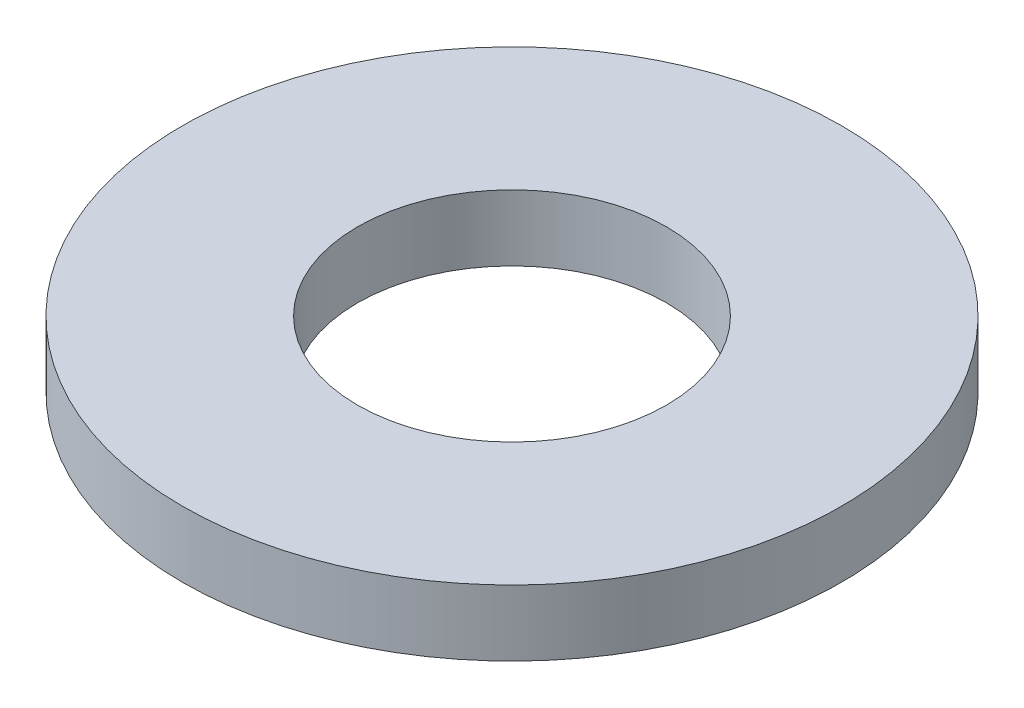
ISO-10303-21;
HEADER;
FILE_DESCRIPTION(('STEP AP214'),'2;1');
FILE_NAME('part.step','',(''),(''),'','','');
FILE_SCHEMA(('AUTOMOTIVE_DESIGN { 1 0 10303 214 1 1 1 1 }'));
ENDSEC;
DATA;
#1=APPLICATION_CONTEXT('core data for automotive mechanical design processes');
#2=APPLICATION_PROTOCOL_DEFINITION('international standard','automotive_design',2000,#1);
#3=PRODUCT_CONTEXT('',#1,'mechanical');
#4=PRODUCT('Part','Part','',(#3));
#5=PRODUCT_RELATED_PRODUCT_CATEGORY('part','',(#4));
#6=PRODUCT_DEFINITION_FORMATION('','',#4);
#7=PRODUCT_DEFINITION_CONTEXT('part definition',#1,'design');
#8=PRODUCT_DEFINITION('design','',#6,#7);
#9=PRODUCT_DEFINITION_SHAPE('','',#8);
#10=(LENGTH_UNIT() NAMED_UNIT(*) SI_UNIT(.MILLI.,.METRE.));
#11=(NAMED_UNIT(*) PLANE_ANGLE_UNIT() SI_UNIT($,.RADIAN.));
#12=(NAMED_UNIT(*) SI_UNIT($,.STERADIAN.) SOLID_ANGLE_UNIT());
#13=UNCERTAINTY_MEASURE_WITH_UNIT(LENGTH_MEASURE(1.E-05),#10,'distance_accuracy_value','');
#14=(GEOMETRIC_REPRESENTATION_CONTEXT(3) GLOBAL_UNCERTAINTY_ASSIGNED_CONTEXT((#13)) GLOBAL_UNIT_ASSIGNED_CONTEXT((#10,
#11,#12)) REPRESENTATION_CONTEXT('',''));
#15=CARTESIAN_POINT('',(0.,0.,0.));
#16=DIRECTION('',(0.,0.,1.));
#17=DIRECTION('',(1.,0.,0.));
#18=AXIS2_PLACEMENT_3D('',#15,#16,#17);
#19=CARTESIAN_POINT('',(0.,16.,0.));
#20=DIRECTION('',(0.,-1.,0.));
#21=DIRECTION('',(0.,0.,-1.));
#22=AXIS2_PLACEMENT_3D('',#19,#20,#21);
#23=CYLINDRICAL_SURFACE('',#22,80.);
#24=CARTESIAN_POINT('',(0.,16.,0.));
#25=DIRECTION('',(0.,1.,0.));
#26=DIRECTION('',(0.,0.,1.));
#27=AXIS2_PLACEMENT_3D('',#24,#25,#26);
#28=CIRCLE('',#27,80.);
#29=CARTESIAN_POINT('',(0.,16.,80.));
#30=VERTEX_POINT('',#29);
#31=EDGE_CURVE('E10',#30,#30,#28,.T.);
#32=ORIENTED_EDGE('',*,*,#31,.F.);
#33=EDGE_LOOP('',(#32));
#34=FACE_BOUND('',#33,.T.);
#35=CARTESIAN_POINT('',(0.,0.,0.));
#36=DIRECTION('',(0.,1.,0.));
#37=DIRECTION('',(0.,0.,1.));
#38=AXIS2_PLACEMENT_3D('',#35,#36,#37);
#39=CIRCLE('',#38,80.);
#40=CARTESIAN_POINT('',(0.,0.,80.));
#41=VERTEX_POINT('',#40);
#42=EDGE_CURVE('E37',#41,#41,#39,.T.);
#43=ORIENTED_EDGE('',*,*,#42,.T.);
#44=EDGE_LOOP('',(#43));
#45=FACE_BOUND('',#44,.T.);
#46=ADVANCED_FACE('F40',(#34,#45),#23,.T.);
#47=CARTESIAN_POINT('',(0.,16.,0.));
#48=DIRECTION('',(0.,1.,0.));
#49=DIRECTION('',(0.,0.,1.));
#50=AXIS2_PLACEMENT_3D('',#47,#48,#49);
#51=PLANE('',#50);
#52=CARTESIAN_POINT('',(0.,16.,0.));
#53=DIRECTION('',(0.,1.,0.));
#54=DIRECTION('',(0.,0.,1.));
#55=AXIS2_PLACEMENT_3D('',#52,#53,#54);
#56=CIRCLE('',#55,37.5);
#57=CARTESIAN_POINT('',(0.,16.,37.5));
#58=VERTEX_POINT('',#57);
#59=EDGE_CURVE('E50',#58,#58,#56,.T.);
#60=ORIENTED_EDGE('',*,*,#59,.F.);
#61=EDGE_LOOP('',(#60));
#62=FACE_BOUND('',#61,.T.);
#63=ORIENTED_EDGE('',*,*,#31,.T.);
#64=EDGE_LOOP('',(#63));
#65=FACE_BOUND('',#64,.T.);
#66=ADVANCED_FACE('F59',(#62,#65),#51,.T.);
#67=CARTESIAN_POINT('',(0.,0.,0.));
#68=DIRECTION('',(0.,1.,0.));
#69=DIRECTION('',(0.,0.,1.));
#70=AXIS2_PLACEMENT_3D('',#67,#68,#69);
#71=PLANE('',#70);
#72=CARTESIAN_POINT('',(0.,0.,0.));
#73=DIRECTION('',(0.,1.,0.));
#74=DIRECTION('',(0.,0.,1.));
#75=AXIS2_PLACEMENT_3D('',#72,#73,#74);
#76=CIRCLE('',#75,37.5);
#77=CARTESIAN_POINT('',(0.,0.,37.5));
#78=VERTEX_POINT('',#77);
#79=EDGE_CURVE('E47',#78,#78,#76,.T.);
#80=ORIENTED_EDGE('',*,*,#79,.T.);
#81=EDGE_LOOP('',(#80));
#82=FACE_BOUND('',#81,.T.);
#83=ORIENTED_EDGE('',*,*,#42,.F.);
#84=EDGE_LOOP('',(#83));
#85=FACE_BOUND('',#84,.T.);
#86=ADVANCED_FACE('F58',(#82,#85),#71,.F.);
#87=CARTESIAN_POINT('',(0.,16.,0.));
#88=DIRECTION('',(0.,-1.,0.));
#89=DIRECTION('',(0.,0.,-1.));
#90=AXIS2_PLACEMENT_3D('',#87,#88,#89);
#91=CYLINDRICAL_SURFACE('',#90,37.5);
#92=ORIENTED_EDGE('',*,*,#59,.T.);
#93=EDGE_LOOP('',(#92));
#94=FACE_BOUND('',#93,.T.);
#95=ORIENTED_EDGE('',*,*,#79,.F.);
#96=EDGE_LOOP('',(#95));
#97=FACE_BOUND('',#96,.T.);
#98=ADVANCED_FACE('F54',(#94,#97),#91,.F.);
#99=CLOSED_SHELL('',(#46,#66,#86,#98));
#100=MANIFOLD_SOLID_BREP('B2',#99);
#101=ADVANCED_BREP_SHAPE_REPRESENTATION('',(#18,#100),#14);
#102=SHAPE_DEFINITION_REPRESENTATION(#9,#101);
ENDSEC;
END-ISO-10303-21;
